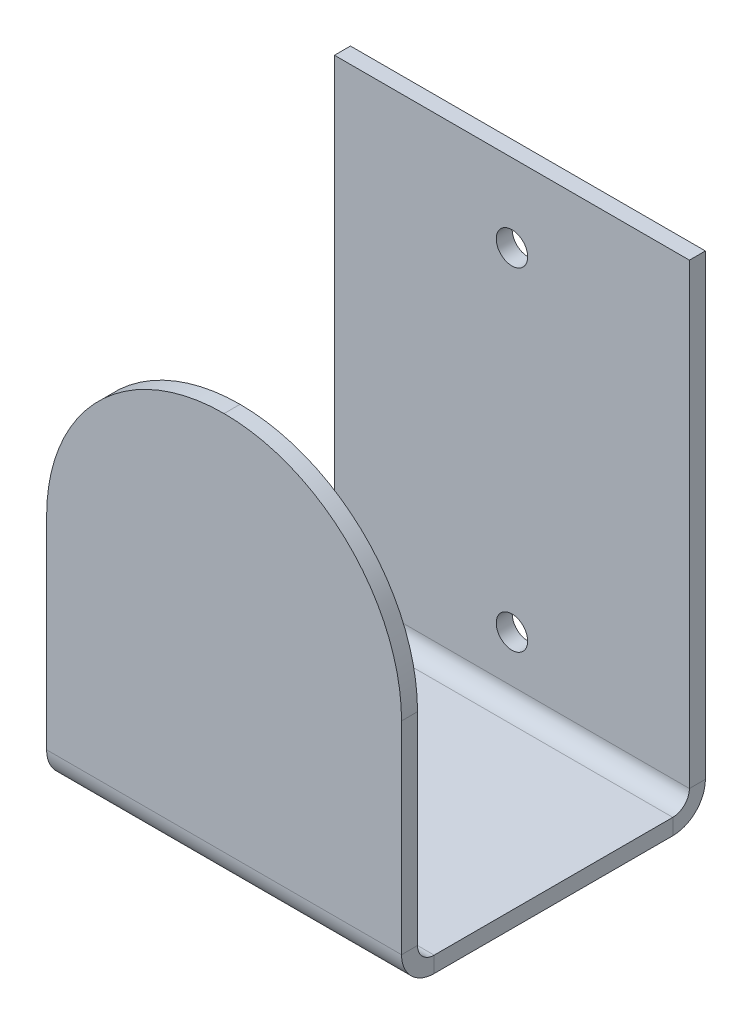
ISO-10303-21;
HEADER;
FILE_DESCRIPTION(('STEP AP214'),'2;1');
FILE_NAME('part.step','',(''),(''),'','','');
FILE_SCHEMA(('AUTOMOTIVE_DESIGN { 1 0 10303 214 1 1 1 1 }'));
ENDSEC;
DATA;
#1=APPLICATION_CONTEXT('core data for automotive mechanical design processes');
#2=APPLICATION_PROTOCOL_DEFINITION('international standard','automotive_design',2000,#1);
#3=PRODUCT_CONTEXT('',#1,'mechanical');
#4=PRODUCT('Part','Part','',(#3));
#5=PRODUCT_RELATED_PRODUCT_CATEGORY('part','',(#4));
#6=PRODUCT_DEFINITION_FORMATION('','',#4);
#7=PRODUCT_DEFINITION_CONTEXT('part definition',#1,'design');
#8=PRODUCT_DEFINITION('design','',#6,#7);
#9=PRODUCT_DEFINITION_SHAPE('','',#8);
#10=(LENGTH_UNIT() NAMED_UNIT(*) SI_UNIT(.MILLI.,.METRE.));
#11=(NAMED_UNIT(*) PLANE_ANGLE_UNIT() SI_UNIT($,.RADIAN.));
#12=(NAMED_UNIT(*) SI_UNIT($,.STERADIAN.) SOLID_ANGLE_UNIT());
#13=UNCERTAINTY_MEASURE_WITH_UNIT(LENGTH_MEASURE(1.E-05),#10,'distance_accuracy_value','');
#14=(GEOMETRIC_REPRESENTATION_CONTEXT(3) GLOBAL_UNCERTAINTY_ASSIGNED_CONTEXT((#13)) GLOBAL_UNIT_ASSIGNED_CONTEXT((#10,
#11,#12)) REPRESENTATION_CONTEXT('',''));
#15=CARTESIAN_POINT('',(0.,0.,0.));
#16=DIRECTION('',(0.,0.,1.));
#17=DIRECTION('',(1.,0.,0.));
#18=AXIS2_PLACEMENT_3D('',#15,#16,#17);
#19=CARTESIAN_POINT('',(-58.7375,98.1131894773532,-66.3631894773534));
#20=DIRECTION('',(-1.,0.,0.));
#21=DIRECTION('',(0.,0.,1.));
#22=AXIS2_PLACEMENT_3D('',#19,#20,#21);
#23=PLANE('',#22);
#24=DIRECTION('',(0.,0.,1.));
#25=VECTOR('',#24,1.);
#26=CARTESIAN_POINT('',(-58.7375,98.1131894773532,-66.3631894773534));
#27=LINE('',#26,#25);
#28=CARTESIAN_POINT('',(-58.7375,98.1131894773535,4.66725));
#29=VERTEX_POINT('',#28);
#30=CARTESIAN_POINT('',(-58.7375,98.1131894773536,38.8188710452931));
#31=VERTEX_POINT('',#30);
#32=EDGE_CURVE('E288',#29,#31,#27,.T.);
#33=ORIENTED_EDGE('',*,*,#32,.T.);
#34=DIRECTION('',(0.,1.,0.));
#35=VECTOR('',#34,1.);
#36=CARTESIAN_POINT('',(-58.7375,98.1131894773536,38.8188710452931));
#37=LINE('',#36,#35);
#38=CARTESIAN_POINT('',(-58.7375,100.399189477354,38.8188710452931));
#39=VERTEX_POINT('',#38);
#40=EDGE_CURVE('E12',#31,#39,#37,.T.);
#41=ORIENTED_EDGE('',*,*,#40,.T.);
#42=DIRECTION('',(0.,0.,-1.));
#43=VECTOR('',#42,1.);
#44=CARTESIAN_POINT('',(-58.7375,100.399189477354,101.911810522647));
#45=LINE('',#44,#43);
#46=CARTESIAN_POINT('',(-58.7375,100.399189477353,4.66725000000001));
#47=VERTEX_POINT('',#46);
#48=EDGE_CURVE('E312',#47,#39,#45,.F.);
#49=ORIENTED_EDGE('',*,*,#48,.F.);
#50=DIRECTION('',(0.,-1.,0.));
#51=VECTOR('',#50,1.);
#52=CARTESIAN_POINT('',(-58.7375,98.113189477353,4.66725000000001));
#53=LINE('',#52,#51);
#54=EDGE_CURVE('E287',#47,#29,#53,.T.);
#55=ORIENTED_EDGE('',*,*,#54,.T.);
#56=EDGE_LOOP('',(#33,#41,#49,#55));
#57=FACE_BOUND('',#56,.T.);
#58=ADVANCED_FACE('F51',(#57),#23,.T.);
#59=CARTESIAN_POINT('',(-7.9375,98.1131894773532,-66.3631894773534));
#60=DIRECTION('',(1.,0.,0.));
#61=DIRECTION('',(0.,0.,-1.));
#62=AXIS2_PLACEMENT_3D('',#59,#60,#61);
#63=PLANE('',#62);
#64=DIRECTION('',(0.,0.,-1.));
#65=VECTOR('',#64,1.);
#66=CARTESIAN_POINT('',(-7.93750000000002,100.399189477354,101.911810522647));
#67=LINE('',#66,#65);
#68=CARTESIAN_POINT('',(-7.93750000000001,100.399189477354,38.8188710452931));
#69=VERTEX_POINT('',#68);
#70=CARTESIAN_POINT('',(-7.93750000000002,100.399189477353,4.66725000000001));
#71=VERTEX_POINT('',#70);
#72=EDGE_CURVE('E76',#69,#71,#67,.T.);
#73=ORIENTED_EDGE('',*,*,#72,.F.);
#74=DIRECTION('',(0.,-1.,0.));
#75=VECTOR('',#74,1.);
#76=CARTESIAN_POINT('',(-7.93750000000001,98.1131894773536,38.8188710452931));
#77=LINE('',#76,#75);
#78=CARTESIAN_POINT('',(-7.93750000000001,98.1131894773536,38.8188710452931));
#79=VERTEX_POINT('',#78);
#80=EDGE_CURVE('E300',#69,#79,#77,.T.);
#81=ORIENTED_EDGE('',*,*,#80,.T.);
#82=DIRECTION('',(0.,0.,-1.));
#83=VECTOR('',#82,1.);
#84=CARTESIAN_POINT('',(-7.9375,98.1131894773532,-66.3631894773534));
#85=LINE('',#84,#83);
#86=CARTESIAN_POINT('',(-7.93750000000001,98.1131894773535,4.66725000000001));
#87=VERTEX_POINT('',#86);
#88=EDGE_CURVE('E309',#79,#87,#85,.T.);
#89=ORIENTED_EDGE('',*,*,#88,.T.);
#90=DIRECTION('',(0.,1.,0.));
#91=VECTOR('',#90,1.);
#92=CARTESIAN_POINT('',(-7.93750000000001,98.113189477353,4.66725000000001));
#93=LINE('',#92,#91);
#94=EDGE_CURVE('E294',#87,#71,#93,.T.);
#95=ORIENTED_EDGE('',*,*,#94,.T.);
#96=EDGE_LOOP('',(#73,#81,#89,#95));
#97=FACE_BOUND('',#96,.T.);
#98=ADVANCED_FACE('F388',(#97),#63,.T.);
#99=CARTESIAN_POINT('',(0.,100.399189477354,101.911810522647));
#100=DIRECTION('',(0.,1.,0.));
#101=DIRECTION('',(1.,0.,0.));
#102=AXIS2_PLACEMENT_3D('',#99,#100,#101);
#103=PLANE('',#102);
#104=ORIENTED_EDGE('',*,*,#48,.T.);
#105=DIRECTION('',(1.,0.,0.));
#106=VECTOR('',#105,1.);
#107=CARTESIAN_POINT('',(0.,100.399189477354,38.8188710452931));
#108=LINE('',#107,#106);
#109=EDGE_CURVE('E60',#39,#69,#108,.T.);
#110=ORIENTED_EDGE('',*,*,#109,.T.);
#111=ORIENTED_EDGE('',*,*,#72,.T.);
#112=DIRECTION('',(-1.,0.,0.));
#113=VECTOR('',#112,1.);
#114=CARTESIAN_POINT('',(0.,100.399189477353,4.66725000000001));
#115=LINE('',#114,#113);
#116=EDGE_CURVE('E291',#71,#47,#115,.T.);
#117=ORIENTED_EDGE('',*,*,#116,.T.);
#118=EDGE_LOOP('',(#104,#110,#111,#117));
#119=FACE_BOUND('',#118,.T.);
#120=ADVANCED_FACE('F409',(#119),#103,.T.);
#121=CARTESIAN_POINT('',(0.,98.1131894773538,101.911810522647));
#122=DIRECTION('',(0.,1.,0.));
#123=DIRECTION('',(1.,0.,0.));
#124=AXIS2_PLACEMENT_3D('',#121,#122,#123);
#125=PLANE('',#124);
#126=DIRECTION('',(1.,0.,0.));
#127=VECTOR('',#126,1.);
#128=CARTESIAN_POINT('',(0.,98.1131894773536,38.8188710452931));
#129=LINE('',#128,#127);
#130=EDGE_CURVE('E297',#31,#79,#129,.T.);
#131=ORIENTED_EDGE('',*,*,#130,.F.);
#132=ORIENTED_EDGE('',*,*,#32,.F.);
#133=DIRECTION('',(-1.,0.,0.));
#134=VECTOR('',#133,1.);
#135=CARTESIAN_POINT('',(0.,98.1131894773535,4.66725000000001));
#136=LINE('',#135,#134);
#137=EDGE_CURVE('E283',#87,#29,#136,.T.);
#138=ORIENTED_EDGE('',*,*,#137,.F.);
#139=ORIENTED_EDGE('',*,*,#88,.F.);
#140=EDGE_LOOP('',(#131,#132,#138,#139));
#141=FACE_BOUND('',#140,.T.);
#142=ADVANCED_FACE('F352',(#141),#125,.F.);
#143=CARTESIAN_POINT('',(-58.7375,168.275,0.));
#144=DIRECTION('',(0.,1.,0.));
#145=DIRECTION('',(-1.,0.,0.));
#146=AXIS2_PLACEMENT_3D('',#143,#144,#145);
#147=PLANE('',#146);
#148=DIRECTION('',(0.,0.,-1.));
#149=VECTOR('',#148,1.);
#150=CARTESIAN_POINT('',(-58.7375,168.275,0.));
#151=LINE('',#150,#149);
#152=CARTESIAN_POINT('',(-58.7375,168.275,2.286));
#153=VERTEX_POINT('',#152);
#154=CARTESIAN_POINT('',(-58.7375,168.275,0.));
#155=VERTEX_POINT('',#154);
#156=EDGE_CURVE('E257',#153,#155,#151,.T.);
#157=ORIENTED_EDGE('',*,*,#156,.F.);
#158=DIRECTION('',(1.,0.,0.));
#159=VECTOR('',#158,1.);
#160=CARTESIAN_POINT('',(0.,168.275,2.286));
#161=LINE('',#160,#159);
#162=CARTESIAN_POINT('',(-7.9375,168.275,2.286));
#163=VERTEX_POINT('',#162);
#164=EDGE_CURVE('E247',#163,#153,#161,.F.);
#165=ORIENTED_EDGE('',*,*,#164,.F.);
#166=DIRECTION('',(0.,0.,-1.));
#167=VECTOR('',#166,1.);
#168=CARTESIAN_POINT('',(-7.9375,168.275,0.));
#169=LINE('',#168,#167);
#170=CARTESIAN_POINT('',(-7.9375,168.275,0.));
#171=VERTEX_POINT('',#170);
#172=EDGE_CURVE('E268',#163,#171,#169,.T.);
#173=ORIENTED_EDGE('',*,*,#172,.T.);
#174=DIRECTION('',(-1.,0.,0.));
#175=VECTOR('',#174,1.);
#176=CARTESIAN_POINT('',(-58.7375,168.275,0.));
#177=LINE('',#176,#175);
#178=EDGE_CURVE('E264',#171,#155,#177,.T.);
#179=ORIENTED_EDGE('',*,*,#178,.T.);
#180=EDGE_LOOP('',(#157,#165,#173,#179));
#181=FACE_BOUND('',#180,.T.);
#182=ADVANCED_FACE('F381',(#181),#147,.T.);
#183=CARTESIAN_POINT('',(0.,0.,0.));
#184=DIRECTION('',(0.,0.,1.));
#185=DIRECTION('',(1.,0.,0.));
#186=AXIS2_PLACEMENT_3D('',#183,#184,#185);
#187=PLANE('',#186);
#188=CARTESIAN_POINT('',(-33.3375,157.1,0.));
#189=DIRECTION('',(0.,0.,1.));
#190=DIRECTION('',(1.,0.,0.));
#191=AXIS2_PLACEMENT_3D('',#188,#189,#190);
#192=CIRCLE('',#191,2.25);
#193=CARTESIAN_POINT('',(-31.0875,157.1,0.));
#194=VERTEX_POINT('',#193);
#195=EDGE_CURVE('E54',#194,#194,#192,.T.);
#196=ORIENTED_EDGE('',*,*,#195,.T.);
#197=EDGE_LOOP('',(#196));
#198=FACE_BOUND('',#197,.T.);
#199=CARTESIAN_POINT('',(-33.3375,109.475,0.));
#200=DIRECTION('',(0.,0.,1.));
#201=DIRECTION('',(1.,0.,0.));
#202=AXIS2_PLACEMENT_3D('',#199,#200,#201);
#203=CIRCLE('',#202,2.25);
#204=CARTESIAN_POINT('',(-31.0875,109.475,0.));
#205=VERTEX_POINT('',#204);
#206=EDGE_CURVE('E209',#205,#205,#203,.T.);
#207=ORIENTED_EDGE('',*,*,#206,.T.);
#208=EDGE_LOOP('',(#207));
#209=FACE_BOUND('',#208,.T.);
#210=DIRECTION('',(0.,1.,0.));
#211=VECTOR('',#210,1.);
#212=CARTESIAN_POINT('',(-7.9375,168.275,0.));
#213=LINE('',#212,#211);
#214=CARTESIAN_POINT('',(-7.93750000000001,102.780439477353,0.));
#215=VERTEX_POINT('',#214);
#216=EDGE_CURVE('E241',#215,#171,#213,.T.);
#217=ORIENTED_EDGE('',*,*,#216,.F.);
#218=DIRECTION('',(-1.,0.,0.));
#219=VECTOR('',#218,1.);
#220=CARTESIAN_POINT('',(0.,102.780439477353,0.));
#221=LINE('',#220,#219);
#222=CARTESIAN_POINT('',(-58.7375,102.780439477353,0.));
#223=VERTEX_POINT('',#222);
#224=EDGE_CURVE('E260',#215,#223,#221,.T.);
#225=ORIENTED_EDGE('',*,*,#224,.T.);
#226=DIRECTION('',(0.,-1.,0.));
#227=VECTOR('',#226,1.);
#228=CARTESIAN_POINT('',(-58.7375,168.275,0.));
#229=LINE('',#228,#227);
#230=EDGE_CURVE('E254',#155,#223,#229,.T.);
#231=ORIENTED_EDGE('',*,*,#230,.F.);
#232=ORIENTED_EDGE('',*,*,#178,.F.);
#233=EDGE_LOOP('',(#217,#225,#231,#232));
#234=FACE_BOUND('',#233,.T.);
#235=ADVANCED_FACE('F424',(#198,#209,#234),#187,.F.);
#236=CARTESIAN_POINT('',(-58.7375,168.275,0.));
#237=DIRECTION('',(-1.,0.,0.));
#238=DIRECTION('',(0.,-1.,0.));
#239=AXIS2_PLACEMENT_3D('',#236,#237,#238);
#240=PLANE('',#239);
#241=DIRECTION('',(0.,0.,-1.));
#242=VECTOR('',#241,1.);
#243=CARTESIAN_POINT('',(-58.7375,102.780439477353,-4.57346071721105E-13));
#244=LINE('',#243,#242);
#245=CARTESIAN_POINT('',(-58.7375,102.780439477353,2.286));
#246=VERTEX_POINT('',#245);
#247=EDGE_CURVE('E272',#246,#223,#244,.T.);
#248=ORIENTED_EDGE('',*,*,#247,.F.);
#249=DIRECTION('',(0.,1.,0.));
#250=VECTOR('',#249,1.);
#251=CARTESIAN_POINT('',(-58.7375,0.,2.286));
#252=LINE('',#251,#250);
#253=EDGE_CURVE('E244',#153,#246,#252,.F.);
#254=ORIENTED_EDGE('',*,*,#253,.F.);
#255=ORIENTED_EDGE('',*,*,#156,.T.);
#256=ORIENTED_EDGE('',*,*,#230,.T.);
#257=EDGE_LOOP('',(#248,#254,#255,#256));
#258=FACE_BOUND('',#257,.T.);
#259=ADVANCED_FACE('F384',(#258),#240,.T.);
#260=CARTESIAN_POINT('',(0.,0.,2.286));
#261=DIRECTION('',(0.,0.,1.));
#262=DIRECTION('',(1.,0.,0.));
#263=AXIS2_PLACEMENT_3D('',#260,#261,#262);
#264=PLANE('',#263);
#265=CARTESIAN_POINT('',(-33.3375,157.1,2.286));
#266=DIRECTION('',(0.,0.,1.));
#267=DIRECTION('',(1.,0.,0.));
#268=AXIS2_PLACEMENT_3D('',#265,#266,#267);
#269=CIRCLE('',#268,2.25);
#270=CARTESIAN_POINT('',(-31.0875,157.1,2.286));
#271=VERTEX_POINT('',#270);
#272=EDGE_CURVE('E329',#271,#271,#269,.T.);
#273=ORIENTED_EDGE('',*,*,#272,.F.);
#274=EDGE_LOOP('',(#273));
#275=FACE_BOUND('',#274,.T.);
#276=CARTESIAN_POINT('',(-33.3375,109.475,2.286));
#277=DIRECTION('',(0.,0.,1.));
#278=DIRECTION('',(1.,0.,0.));
#279=AXIS2_PLACEMENT_3D('',#276,#277,#278);
#280=CIRCLE('',#279,2.25);
#281=CARTESIAN_POINT('',(-31.0875,109.475,2.286));
#282=VERTEX_POINT('',#281);
#283=EDGE_CURVE('E319',#282,#282,#280,.T.);
#284=ORIENTED_EDGE('',*,*,#283,.F.);
#285=EDGE_LOOP('',(#284));
#286=FACE_BOUND('',#285,.T.);
#287=DIRECTION('',(-1.,0.,0.));
#288=VECTOR('',#287,1.);
#289=CARTESIAN_POINT('',(0.,102.780439477353,2.286));
#290=LINE('',#289,#288);
#291=CARTESIAN_POINT('',(-7.93750000000002,102.780439477353,2.286));
#292=VERTEX_POINT('',#291);
#293=EDGE_CURVE('E276',#292,#246,#290,.T.);
#294=ORIENTED_EDGE('',*,*,#293,.F.);
#295=DIRECTION('',(0.,1.,0.));
#296=VECTOR('',#295,1.);
#297=CARTESIAN_POINT('',(-7.93750000000002,0.,2.286));
#298=LINE('',#297,#296);
#299=EDGE_CURVE('E251',#292,#163,#298,.T.);
#300=ORIENTED_EDGE('',*,*,#299,.T.);
#301=ORIENTED_EDGE('',*,*,#164,.T.);
#302=ORIENTED_EDGE('',*,*,#253,.T.);
#303=EDGE_LOOP('',(#294,#300,#301,#302));
#304=FACE_BOUND('',#303,.T.);
#305=ADVANCED_FACE('F366',(#275,#286,#304),#264,.T.);
#306=CARTESIAN_POINT('',(-7.9375,168.275,0.));
#307=DIRECTION('',(1.,0.,0.));
#308=DIRECTION('',(0.,1.,0.));
#309=AXIS2_PLACEMENT_3D('',#306,#307,#308);
#310=PLANE('',#309);
#311=DIRECTION('',(0.,0.,1.));
#312=VECTOR('',#311,1.);
#313=CARTESIAN_POINT('',(-7.93750000000001,102.780439477353,-4.57346071721105E-13));
#314=LINE('',#313,#312);
#315=EDGE_CURVE('E234',#215,#292,#314,.T.);
#316=ORIENTED_EDGE('',*,*,#315,.F.);
#317=ORIENTED_EDGE('',*,*,#216,.T.);
#318=ORIENTED_EDGE('',*,*,#172,.F.);
#319=ORIENTED_EDGE('',*,*,#299,.F.);
#320=EDGE_LOOP('',(#316,#317,#318,#319));
#321=FACE_BOUND('',#320,.T.);
#322=ADVANCED_FACE('F377',(#321),#310,.T.);
#323=CARTESIAN_POINT('',(-7.9375,102.780439477353,4.66725));
#324=DIRECTION('',(1.,0.,0.));
#325=DIRECTION('',(0.,0.,-1.));
#326=AXIS2_PLACEMENT_3D('',#323,#324,#325);
#327=PLANE('',#326);
#328=ORIENTED_EDGE('',*,*,#315,.T.);
#329=CARTESIAN_POINT('',(-7.93749999999999,102.780439477353,4.66725));
#330=DIRECTION('',(-1.,0.,0.));
#331=DIRECTION('',(0.,0.,1.));
#332=AXIS2_PLACEMENT_3D('',#329,#330,#331);
#333=CIRCLE('',#332,2.38125);
#334=EDGE_CURVE('E219',#292,#71,#333,.T.);
#335=ORIENTED_EDGE('',*,*,#334,.T.);
#336=ORIENTED_EDGE('',*,*,#94,.F.);
#337=CARTESIAN_POINT('',(-7.9375,102.780439477353,4.66725));
#338=DIRECTION('',(-1.,0.,0.));
#339=DIRECTION('',(0.,0.,-1.));
#340=AXIS2_PLACEMENT_3D('',#337,#338,#339);
#341=CIRCLE('',#340,4.66725);
#342=EDGE_CURVE('E225',#215,#87,#341,.T.);
#343=ORIENTED_EDGE('',*,*,#342,.F.);
#344=EDGE_LOOP('',(#328,#335,#336,#343));
#345=FACE_BOUND('',#344,.T.);
#346=ADVANCED_FACE('F373',(#345),#327,.T.);
#347=CARTESIAN_POINT('',(-58.7375,102.780439477353,4.66725));
#348=DIRECTION('',(-1.,0.,0.));
#349=DIRECTION('',(0.,0.,1.));
#350=AXIS2_PLACEMENT_3D('',#347,#348,#349);
#351=PLANE('',#350);
#352=ORIENTED_EDGE('',*,*,#54,.F.);
#353=CARTESIAN_POINT('',(-58.7374999999999,102.780439477353,4.66725));
#354=DIRECTION('',(-1.,0.,0.));
#355=DIRECTION('',(0.,0.,1.));
#356=AXIS2_PLACEMENT_3D('',#353,#354,#355);
#357=CIRCLE('',#356,2.38125);
#358=EDGE_CURVE('E230',#47,#246,#357,.F.);
#359=ORIENTED_EDGE('',*,*,#358,.T.);
#360=ORIENTED_EDGE('',*,*,#247,.T.);
#361=CARTESIAN_POINT('',(-58.7375,102.780439477353,4.66725));
#362=DIRECTION('',(1.,0.,0.));
#363=DIRECTION('',(0.,0.,1.));
#364=AXIS2_PLACEMENT_3D('',#361,#362,#363);
#365=CIRCLE('',#364,4.66725);
#366=EDGE_CURVE('E229',#29,#223,#365,.T.);
#367=ORIENTED_EDGE('',*,*,#366,.F.);
#368=EDGE_LOOP('',(#352,#359,#360,#367));
#369=FACE_BOUND('',#368,.T.);
#370=ADVANCED_FACE('F359',(#369),#351,.T.);
#371=CARTESIAN_POINT('',(17.8143499352777,102.780439477353,4.66725));
#372=DIRECTION('',(-1.,0.,0.));
#373=DIRECTION('',(0.,0.,1.));
#374=AXIS2_PLACEMENT_3D('',#371,#372,#373);
#375=CYLINDRICAL_SURFACE('',#374,4.66725);
#376=ORIENTED_EDGE('',*,*,#366,.T.);
#377=ORIENTED_EDGE('',*,*,#224,.F.);
#378=ORIENTED_EDGE('',*,*,#342,.T.);
#379=ORIENTED_EDGE('',*,*,#137,.T.);
#380=EDGE_LOOP('',(#376,#377,#378,#379));
#381=FACE_BOUND('',#380,.T.);
#382=ADVANCED_FACE('F386',(#381),#375,.T.);
#383=CARTESIAN_POINT('',(17.8143499352777,102.780439477353,4.66725));
#384=DIRECTION('',(-1.,0.,0.));
#385=DIRECTION('',(0.,0.,1.));
#386=AXIS2_PLACEMENT_3D('',#383,#384,#385);
#387=CYLINDRICAL_SURFACE('',#386,2.38125);
#388=ORIENTED_EDGE('',*,*,#358,.F.);
#389=ORIENTED_EDGE('',*,*,#116,.F.);
#390=ORIENTED_EDGE('',*,*,#334,.F.);
#391=ORIENTED_EDGE('',*,*,#293,.T.);
#392=EDGE_LOOP('',(#388,#389,#390,#391));
#393=FACE_BOUND('',#392,.T.);
#394=ADVANCED_FACE('F362',(#393),#387,.F.);
#395=CARTESIAN_POINT('',(-58.7375,102.780439477354,38.8188710452931));
#396=DIRECTION('',(-1.,0.,0.));
#397=DIRECTION('',(0.,0.,1.));
#398=AXIS2_PLACEMENT_3D('',#395,#396,#397);
#399=PLANE('',#398);
#400=DIRECTION('',(0.,0.,-1.));
#401=VECTOR('',#400,1.);
#402=CARTESIAN_POINT('',(-58.7375,102.780439477354,43.4861210452931));
#403=LINE('',#402,#401);
#404=CARTESIAN_POINT('',(-58.7375,102.780439477354,43.4861210452931));
#405=VERTEX_POINT('',#404);
#406=CARTESIAN_POINT('',(-58.7375,102.780439477354,41.2001210452931));
#407=VERTEX_POINT('',#406);
#408=EDGE_CURVE('E156',#405,#407,#403,.T.);
#409=ORIENTED_EDGE('',*,*,#408,.T.);
#410=CARTESIAN_POINT('',(-58.7375,102.780439477354,38.8188710452931));
#411=DIRECTION('',(-1.,0.,0.));
#412=DIRECTION('',(0.,0.,1.));
#413=AXIS2_PLACEMENT_3D('',#410,#411,#412);
#414=CIRCLE('',#413,2.38125);
#415=EDGE_CURVE('E68',#407,#39,#414,.F.);
#416=ORIENTED_EDGE('',*,*,#415,.T.);
#417=ORIENTED_EDGE('',*,*,#40,.F.);
#418=CARTESIAN_POINT('',(-58.7375,102.780439477354,38.8188710452931));
#419=DIRECTION('',(1.,0.,0.));
#420=DIRECTION('',(0.,0.,1.));
#421=AXIS2_PLACEMENT_3D('',#418,#419,#420);
#422=CIRCLE('',#421,4.66725);
#423=EDGE_CURVE('E210',#405,#31,#422,.T.);
#424=ORIENTED_EDGE('',*,*,#423,.F.);
#425=EDGE_LOOP('',(#409,#416,#417,#424));
#426=FACE_BOUND('',#425,.T.);
#427=ADVANCED_FACE('F395',(#426),#399,.T.);
#428=CARTESIAN_POINT('',(-7.93750000000001,102.780439477354,38.8188710452931));
#429=DIRECTION('',(1.,0.,0.));
#430=DIRECTION('',(0.,0.,-1.));
#431=AXIS2_PLACEMENT_3D('',#428,#429,#430);
#432=PLANE('',#431);
#433=ORIENTED_EDGE('',*,*,#80,.F.);
#434=CARTESIAN_POINT('',(-7.93750000000001,102.780439477354,38.8188710452931));
#435=DIRECTION('',(-1.,0.,0.));
#436=DIRECTION('',(0.,0.,1.));
#437=AXIS2_PLACEMENT_3D('',#434,#435,#436);
#438=CIRCLE('',#437,2.38125);
#439=CARTESIAN_POINT('',(-7.93750000000002,102.780439477354,41.2001210452931));
#440=VERTEX_POINT('',#439);
#441=EDGE_CURVE('E215',#69,#440,#438,.T.);
#442=ORIENTED_EDGE('',*,*,#441,.T.);
#443=DIRECTION('',(0.,0.,1.));
#444=VECTOR('',#443,1.);
#445=CARTESIAN_POINT('',(-7.93750000000001,102.780439477354,43.4861210452931));
#446=LINE('',#445,#444);
#447=CARTESIAN_POINT('',(-7.93750000000001,102.780439477354,43.486121045293));
#448=VERTEX_POINT('',#447);
#449=EDGE_CURVE('E199',#440,#448,#446,.T.);
#450=ORIENTED_EDGE('',*,*,#449,.T.);
#451=CARTESIAN_POINT('',(-7.93750000000001,102.780439477354,38.8188710452931));
#452=DIRECTION('',(-1.,0.,0.));
#453=DIRECTION('',(0.,0.,-1.));
#454=AXIS2_PLACEMENT_3D('',#451,#452,#453);
#455=CIRCLE('',#454,4.66725);
#456=EDGE_CURVE('E214',#79,#448,#455,.T.);
#457=ORIENTED_EDGE('',*,*,#456,.F.);
#458=EDGE_LOOP('',(#433,#442,#450,#457));
#459=FACE_BOUND('',#458,.T.);
#460=ADVANCED_FACE('F345',(#459),#432,.T.);
#461=CARTESIAN_POINT('',(17.8143499352777,102.780439477354,38.818871045293));
#462=DIRECTION('',(-1.,0.,0.));
#463=DIRECTION('',(0.,0.,1.));
#464=AXIS2_PLACEMENT_3D('',#461,#462,#463);
#465=CYLINDRICAL_SURFACE('',#464,4.66725);
#466=ORIENTED_EDGE('',*,*,#456,.T.);
#467=DIRECTION('',(1.,0.,0.));
#468=VECTOR('',#467,1.);
#469=CARTESIAN_POINT('',(0.,102.780439477354,43.4861210452931));
#470=LINE('',#469,#468);
#471=EDGE_CURVE('E185',#405,#448,#470,.T.);
#472=ORIENTED_EDGE('',*,*,#471,.F.);
#473=ORIENTED_EDGE('',*,*,#423,.T.);
#474=ORIENTED_EDGE('',*,*,#130,.T.);
#475=EDGE_LOOP('',(#466,#472,#473,#474));
#476=FACE_BOUND('',#475,.T.);
#477=ADVANCED_FACE('F348',(#476),#465,.T.);
#478=CARTESIAN_POINT('',(17.8143499352777,102.780439477354,38.818871045293));
#479=DIRECTION('',(-1.,0.,0.));
#480=DIRECTION('',(0.,0.,1.));
#481=AXIS2_PLACEMENT_3D('',#478,#479,#480);
#482=CYLINDRICAL_SURFACE('',#481,2.38125);
#483=ORIENTED_EDGE('',*,*,#441,.F.);
#484=ORIENTED_EDGE('',*,*,#109,.F.);
#485=ORIENTED_EDGE('',*,*,#415,.F.);
#486=DIRECTION('',(1.,0.,0.));
#487=VECTOR('',#486,1.);
#488=CARTESIAN_POINT('',(0.,102.780439477354,41.2001210452931));
#489=LINE('',#488,#487);
#490=EDGE_CURVE('E203',#407,#440,#489,.T.);
#491=ORIENTED_EDGE('',*,*,#490,.T.);
#492=EDGE_LOOP('',(#483,#484,#485,#491));
#493=FACE_BOUND('',#492,.T.);
#494=ADVANCED_FACE('F390',(#493),#482,.F.);
#495=CARTESIAN_POINT('',(-33.3375,131.7625,43.4861210452929));
#496=DIRECTION('',(0.,0.,-1.));
#497=DIRECTION('',(1.,0.,0.));
#498=AXIS2_PLACEMENT_3D('',#495,#496,#497);
#499=CYLINDRICAL_SURFACE('',#498,25.4);
#500=DIRECTION('',(0.,0.,1.));
#501=VECTOR('',#500,1.);
#502=CARTESIAN_POINT('',(-33.3375,157.1625,43.4861210452927));
#503=LINE('',#502,#501);
#504=CARTESIAN_POINT('',(-33.3375,157.1625,41.2001210452927));
#505=VERTEX_POINT('',#504);
#506=CARTESIAN_POINT('',(-33.3375,157.1625,43.4861210452927));
#507=VERTEX_POINT('',#506);
#508=EDGE_CURVE('E191',#505,#507,#503,.T.);
#509=ORIENTED_EDGE('',*,*,#508,.F.);
#510=CARTESIAN_POINT('',(-33.3375,131.7625,41.2001210452929));
#511=DIRECTION('',(0.,0.,-1.));
#512=DIRECTION('',(1.,0.,0.));
#513=AXIS2_PLACEMENT_3D('',#510,#511,#512);
#514=CIRCLE('',#513,25.4);
#515=CARTESIAN_POINT('',(-58.7375,131.7625,41.2001210452929));
#516=VERTEX_POINT('',#515);
#517=EDGE_CURVE('E169',#505,#516,#514,.F.);
#518=ORIENTED_EDGE('',*,*,#517,.T.);
#519=DIRECTION('',(0.,0.,1.));
#520=VECTOR('',#519,1.);
#521=CARTESIAN_POINT('',(-58.7375,131.7625,43.4861210452929));
#522=LINE('',#521,#520);
#523=CARTESIAN_POINT('',(-58.7375,131.7625,43.4861210452929));
#524=VERTEX_POINT('',#523);
#525=EDGE_CURVE('E154',#516,#524,#522,.T.);
#526=ORIENTED_EDGE('',*,*,#525,.T.);
#527=CARTESIAN_POINT('',(-33.3375,131.7625,43.4861210452929));
#528=DIRECTION('',(0.,0.,-1.));
#529=DIRECTION('',(1.,0.,0.));
#530=AXIS2_PLACEMENT_3D('',#527,#528,#529);
#531=CIRCLE('',#530,25.4);
#532=EDGE_CURVE('E167',#507,#524,#531,.F.);
#533=ORIENTED_EDGE('',*,*,#532,.F.);
#534=EDGE_LOOP('',(#509,#518,#526,#533));
#535=FACE_BOUND('',#534,.T.);
#536=ADVANCED_FACE('F166',(#535),#499,.T.);
#537=CARTESIAN_POINT('',(-33.3375,131.7625,43.4861210452929));
#538=DIRECTION('',(0.,0.,-1.));
#539=DIRECTION('',(1.,0.,0.));
#540=AXIS2_PLACEMENT_3D('',#537,#538,#539);
#541=CYLINDRICAL_SURFACE('',#540,25.4);
#542=CARTESIAN_POINT('',(-33.3375,131.7625,41.2001210452929));
#543=DIRECTION('',(0.,0.,-1.));
#544=DIRECTION('',(1.,0.,0.));
#545=AXIS2_PLACEMENT_3D('',#542,#543,#544);
#546=CIRCLE('',#545,25.4);
#547=CARTESIAN_POINT('',(-7.93750000000002,131.7625,41.2001210452929));
#548=VERTEX_POINT('',#547);
#549=EDGE_CURVE('E171',#548,#505,#546,.F.);
#550=ORIENTED_EDGE('',*,*,#549,.T.);
#551=ORIENTED_EDGE('',*,*,#508,.T.);
#552=CARTESIAN_POINT('',(-33.3375,131.7625,43.4861210452929));
#553=DIRECTION('',(0.,0.,-1.));
#554=DIRECTION('',(1.,0.,0.));
#555=AXIS2_PLACEMENT_3D('',#552,#553,#554);
#556=CIRCLE('',#555,25.4);
#557=CARTESIAN_POINT('',(-7.93750000000002,131.7625,43.4861210452929));
#558=VERTEX_POINT('',#557);
#559=EDGE_CURVE('E177',#558,#507,#556,.F.);
#560=ORIENTED_EDGE('',*,*,#559,.F.);
#561=DIRECTION('',(0.,0.,1.));
#562=VECTOR('',#561,1.);
#563=CARTESIAN_POINT('',(-7.93750000000002,131.7625,43.4861210452929));
#564=LINE('',#563,#562);
#565=EDGE_CURVE('E179',#548,#558,#564,.T.);
#566=ORIENTED_EDGE('',*,*,#565,.F.);
#567=EDGE_LOOP('',(#550,#551,#560,#566));
#568=FACE_BOUND('',#567,.T.);
#569=ADVANCED_FACE('F510',(#568),#541,.T.);
#570=CARTESIAN_POINT('',(0.,160.3375,43.4861210452927));
#571=DIRECTION('',(0.,0.,-1.));
#572=DIRECTION('',(1.,0.,0.));
#573=AXIS2_PLACEMENT_3D('',#570,#571,#572);
#574=PLANE('',#573);
#575=DIRECTION('',(0.,1.,0.));
#576=VECTOR('',#575,1.);
#577=CARTESIAN_POINT('',(-58.7375,-7.93749999999983,43.4861210452939));
#578=LINE('',#577,#576);
#579=EDGE_CURVE('E151',#405,#524,#578,.T.);
#580=ORIENTED_EDGE('',*,*,#579,.F.);
#581=ORIENTED_EDGE('',*,*,#471,.T.);
#582=DIRECTION('',(0.,-1.,0.));
#583=VECTOR('',#582,1.);
#584=CARTESIAN_POINT('',(-7.93749999999997,-7.93749999999982,43.4861210452938));
#585=LINE('',#584,#583);
#586=EDGE_CURVE('E183',#558,#448,#585,.T.);
#587=ORIENTED_EDGE('',*,*,#586,.F.);
#588=ORIENTED_EDGE('',*,*,#559,.T.);
#589=ORIENTED_EDGE('',*,*,#532,.T.);
#590=EDGE_LOOP('',(#580,#581,#587,#588,#589));
#591=FACE_BOUND('',#590,.T.);
#592=ADVANCED_FACE('F174',(#591),#574,.F.);
#593=CARTESIAN_POINT('',(-7.93749999999997,-7.93749999999982,43.4861210452938));
#594=DIRECTION('',(1.,0.,0.));
#595=DIRECTION('',(0.,-1.,0.));
#596=AXIS2_PLACEMENT_3D('',#593,#594,#595);
#597=PLANE('',#596);
#598=ORIENTED_EDGE('',*,*,#449,.F.);
#599=DIRECTION('',(0.,-1.,0.));
#600=VECTOR('',#599,1.);
#601=CARTESIAN_POINT('',(-7.93750000000003,160.3375,41.2001210452927));
#602=LINE('',#601,#600);
#603=EDGE_CURVE('E162',#548,#440,#602,.T.);
#604=ORIENTED_EDGE('',*,*,#603,.F.);
#605=ORIENTED_EDGE('',*,*,#565,.T.);
#606=ORIENTED_EDGE('',*,*,#586,.T.);
#607=EDGE_LOOP('',(#598,#604,#605,#606));
#608=FACE_BOUND('',#607,.T.);
#609=ADVANCED_FACE('F339',(#608),#597,.T.);
#610=CARTESIAN_POINT('',(0.,160.3375,41.2001210452927));
#611=DIRECTION('',(0.,0.,-1.));
#612=DIRECTION('',(1.,0.,0.));
#613=AXIS2_PLACEMENT_3D('',#610,#611,#612);
#614=PLANE('',#613);
#615=ORIENTED_EDGE('',*,*,#490,.F.);
#616=DIRECTION('',(0.,-1.,0.));
#617=VECTOR('',#616,1.);
#618=CARTESIAN_POINT('',(-58.7375,160.3375,41.2001210452927));
#619=LINE('',#618,#617);
#620=EDGE_CURVE('E334',#407,#516,#619,.F.);
#621=ORIENTED_EDGE('',*,*,#620,.T.);
#622=ORIENTED_EDGE('',*,*,#517,.F.);
#623=ORIENTED_EDGE('',*,*,#549,.F.);
#624=ORIENTED_EDGE('',*,*,#603,.T.);
#625=EDGE_LOOP('',(#615,#621,#622,#623,#624));
#626=FACE_BOUND('',#625,.T.);
#627=ADVANCED_FACE('F393',(#626),#614,.T.);
#628=CARTESIAN_POINT('',(-58.7375,-7.93749999999983,43.4861210452939));
#629=DIRECTION('',(-1.,0.,0.));
#630=DIRECTION('',(0.,1.,0.));
#631=AXIS2_PLACEMENT_3D('',#628,#629,#630);
#632=PLANE('',#631);
#633=ORIENTED_EDGE('',*,*,#408,.F.);
#634=ORIENTED_EDGE('',*,*,#579,.T.);
#635=ORIENTED_EDGE('',*,*,#525,.F.);
#636=ORIENTED_EDGE('',*,*,#620,.F.);
#637=EDGE_LOOP('',(#633,#634,#635,#636));
#638=FACE_BOUND('',#637,.T.);
#639=ADVANCED_FACE('F153',(#638),#632,.T.);
#640=CARTESIAN_POINT('',(-33.3375,109.475,2.286));
#641=DIRECTION('',(0.,0.,1.));
#642=DIRECTION('',(1.,0.,0.));
#643=AXIS2_PLACEMENT_3D('',#640,#641,#642);
#644=CYLINDRICAL_SURFACE('',#643,2.25);
#645=ORIENTED_EDGE('',*,*,#283,.T.);
#646=EDGE_LOOP('',(#645));
#647=FACE_BOUND('',#646,.T.);
#648=ORIENTED_EDGE('',*,*,#206,.F.);
#649=EDGE_LOOP('',(#648));
#650=FACE_BOUND('',#649,.T.);
#651=ADVANCED_FACE('F557',(#647,#650),#644,.F.);
#652=CARTESIAN_POINT('',(-33.3375,157.1,2.286));
#653=DIRECTION('',(0.,0.,1.));
#654=DIRECTION('',(1.,0.,0.));
#655=AXIS2_PLACEMENT_3D('',#652,#653,#654);
#656=CYLINDRICAL_SURFACE('',#655,2.25);
#657=ORIENTED_EDGE('',*,*,#272,.T.);
#658=EDGE_LOOP('',(#657));
#659=FACE_BOUND('',#658,.T.);
#660=ORIENTED_EDGE('',*,*,#195,.F.);
#661=EDGE_LOOP('',(#660));
#662=FACE_BOUND('',#661,.T.);
#663=ADVANCED_FACE('F582',(#659,#662),#656,.F.);
#664=CLOSED_SHELL('',(#58,#98,#120,#142,#182,#235,#259,#305,#322,#346,#370,#382,#394,#427,#460,
#477,#494,#536,#569,#592,#609,#627,#639,#651,#663));
#665=MANIFOLD_SOLID_BREP('B2',#664);
#666=ADVANCED_BREP_SHAPE_REPRESENTATION('',(#18,#665),#14);
#667=SHAPE_DEFINITION_REPRESENTATION(#9,#666);
ENDSEC;
END-ISO-10303-21;
